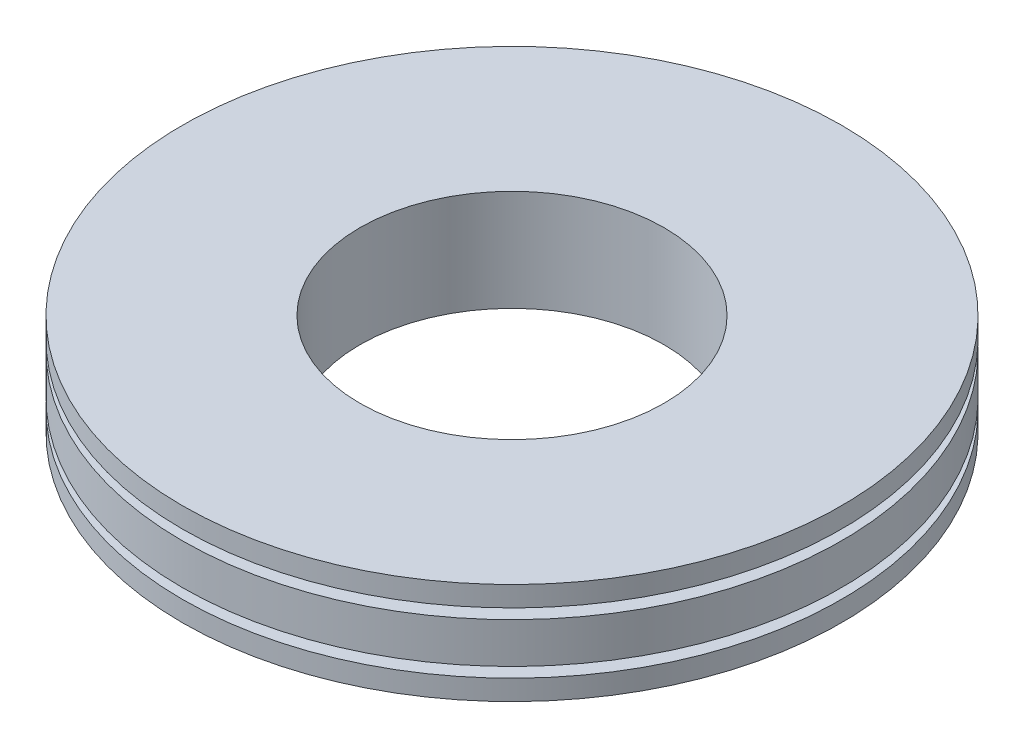
ISO-10303-21;
HEADER;
FILE_DESCRIPTION(('STEP AP214'),'2;1');
FILE_NAME('part.step','',(''),(''),'','','');
FILE_SCHEMA(('AUTOMOTIVE_DESIGN { 1 0 10303 214 1 1 1 1 }'));
ENDSEC;
DATA;
#1=APPLICATION_CONTEXT('core data for automotive mechanical design processes');
#2=APPLICATION_PROTOCOL_DEFINITION('international standard','automotive_design',2000,#1);
#3=PRODUCT_CONTEXT('',#1,'mechanical');
#4=PRODUCT('Part','Part','',(#3));
#5=PRODUCT_RELATED_PRODUCT_CATEGORY('part','',(#4));
#6=PRODUCT_DEFINITION_FORMATION('','',#4);
#7=PRODUCT_DEFINITION_CONTEXT('part definition',#1,'design');
#8=PRODUCT_DEFINITION('design','',#6,#7);
#9=PRODUCT_DEFINITION_SHAPE('','',#8);
#10=(LENGTH_UNIT() NAMED_UNIT(*) SI_UNIT(.MILLI.,.METRE.));
#11=(NAMED_UNIT(*) PLANE_ANGLE_UNIT() SI_UNIT($,.RADIAN.));
#12=(NAMED_UNIT(*) SI_UNIT($,.STERADIAN.) SOLID_ANGLE_UNIT());
#13=UNCERTAINTY_MEASURE_WITH_UNIT(LENGTH_MEASURE(1.E-05),#10,'distance_accuracy_value','');
#14=(GEOMETRIC_REPRESENTATION_CONTEXT(3) GLOBAL_UNCERTAINTY_ASSIGNED_CONTEXT((#13)) GLOBAL_UNIT_ASSIGNED_CONTEXT((#10,
#11,#12)) REPRESENTATION_CONTEXT('',''));
#15=CARTESIAN_POINT('',(0.,0.,0.));
#16=DIRECTION('',(0.,0.,1.));
#17=DIRECTION('',(1.,0.,0.));
#18=AXIS2_PLACEMENT_3D('',#15,#16,#17);
#19=CARTESIAN_POINT('',(0.,4.,0.));
#20=DIRECTION('',(0.,-1.,0.));
#21=DIRECTION('',(0.,0.,-1.));
#22=AXIS2_PLACEMENT_3D('',#19,#20,#21);
#23=CYLINDRICAL_SURFACE('',#22,13.);
#24=CARTESIAN_POINT('',(0.,4.,0.));
#25=DIRECTION('',(0.,1.,0.));
#26=DIRECTION('',(0.,0.,1.));
#27=AXIS2_PLACEMENT_3D('',#24,#25,#26);
#28=CIRCLE('',#27,13.);
#29=CARTESIAN_POINT('',(0.,4.,13.));
#30=VERTEX_POINT('',#29);
#31=EDGE_CURVE('E10',#30,#30,#28,.T.);
#32=ORIENTED_EDGE('',*,*,#31,.F.);
#33=EDGE_LOOP('',(#32));
#34=FACE_BOUND('',#33,.T.);
#35=CARTESIAN_POINT('',(0.,3.2,0.));
#36=DIRECTION('',(0.,-1.,0.));
#37=DIRECTION('',(0.,0.,-1.));
#38=AXIS2_PLACEMENT_3D('',#35,#36,#37);
#39=CIRCLE('',#38,13.);
#40=CARTESIAN_POINT('',(0.,3.2,-13.));
#41=VERTEX_POINT('',#40);
#42=EDGE_CURVE('E75',#41,#41,#39,.T.);
#43=ORIENTED_EDGE('',*,*,#42,.F.);
#44=EDGE_LOOP('',(#43));
#45=FACE_BOUND('',#44,.T.);
#46=ADVANCED_FACE('F36',(#34,#45),#23,.T.);
#47=CARTESIAN_POINT('',(0.,2.8,0.));
#48=DIRECTION('',(0.,-1.,0.));
#49=DIRECTION('',(0.,0.,-1.));
#50=AXIS2_PLACEMENT_3D('',#47,#48,#49);
#51=CIRCLE('',#50,13.);
#52=CARTESIAN_POINT('',(0.,2.8,-13.));
#53=VERTEX_POINT('',#52);
#54=EDGE_CURVE('E71',#53,#53,#51,.T.);
#55=ORIENTED_EDGE('',*,*,#54,.T.);
#56=EDGE_LOOP('',(#55));
#57=FACE_BOUND('',#56,.T.);
#58=CARTESIAN_POINT('',(0.,1.2,0.));
#59=DIRECTION('',(0.,-1.,0.));
#60=DIRECTION('',(0.,0.,-1.));
#61=AXIS2_PLACEMENT_3D('',#58,#59,#60);
#62=CIRCLE('',#61,13.);
#63=CARTESIAN_POINT('',(0.,1.2,-13.));
#64=VERTEX_POINT('',#63);
#65=EDGE_CURVE('E55',#64,#64,#62,.T.);
#66=ORIENTED_EDGE('',*,*,#65,.F.);
#67=EDGE_LOOP('',(#66));
#68=FACE_BOUND('',#67,.T.);
#69=ADVANCED_FACE('F111',(#57,#68),#23,.T.);
#70=CARTESIAN_POINT('',(0.,0.8,0.));
#71=DIRECTION('',(0.,-1.,0.));
#72=DIRECTION('',(0.,0.,-1.));
#73=AXIS2_PLACEMENT_3D('',#70,#71,#72);
#74=CIRCLE('',#73,13.);
#75=CARTESIAN_POINT('',(0.,0.8,-13.));
#76=VERTEX_POINT('',#75);
#77=EDGE_CURVE('E59',#76,#76,#74,.T.);
#78=ORIENTED_EDGE('',*,*,#77,.T.);
#79=EDGE_LOOP('',(#78));
#80=FACE_BOUND('',#79,.T.);
#81=CARTESIAN_POINT('',(0.,0.,0.));
#82=DIRECTION('',(0.,1.,0.));
#83=DIRECTION('',(0.,0.,1.));
#84=AXIS2_PLACEMENT_3D('',#81,#82,#83);
#85=CIRCLE('',#84,13.);
#86=CARTESIAN_POINT('',(0.,0.,13.));
#87=VERTEX_POINT('',#86);
#88=EDGE_CURVE('E40',#87,#87,#85,.T.);
#89=ORIENTED_EDGE('',*,*,#88,.T.);
#90=EDGE_LOOP('',(#89));
#91=FACE_BOUND('',#90,.T.);
#92=ADVANCED_FACE('F38',(#80,#91),#23,.T.);
#93=CARTESIAN_POINT('',(0.,4.,0.));
#94=DIRECTION('',(0.,1.,0.));
#95=DIRECTION('',(0.,0.,1.));
#96=AXIS2_PLACEMENT_3D('',#93,#94,#95);
#97=PLANE('',#96);
#98=CARTESIAN_POINT('',(0.,4.,0.));
#99=DIRECTION('',(0.,-1.,0.));
#100=DIRECTION('',(0.,0.,-1.));
#101=AXIS2_PLACEMENT_3D('',#98,#99,#100);
#102=CIRCLE('',#101,6.);
#103=CARTESIAN_POINT('',(0.,4.,-6.));
#104=VERTEX_POINT('',#103);
#105=EDGE_CURVE('E49',#104,#104,#102,.T.);
#106=ORIENTED_EDGE('',*,*,#105,.T.);
#107=EDGE_LOOP('',(#106));
#108=FACE_BOUND('',#107,.T.);
#109=ORIENTED_EDGE('',*,*,#31,.T.);
#110=EDGE_LOOP('',(#109));
#111=FACE_BOUND('',#110,.T.);
#112=ADVANCED_FACE('F120',(#108,#111),#97,.T.);
#113=CARTESIAN_POINT('',(0.,0.,0.));
#114=DIRECTION('',(0.,1.,0.));
#115=DIRECTION('',(0.,0.,1.));
#116=AXIS2_PLACEMENT_3D('',#113,#114,#115);
#117=PLANE('',#116);
#118=CARTESIAN_POINT('',(0.,0.,0.));
#119=DIRECTION('',(0.,-1.,0.));
#120=DIRECTION('',(0.,0.,-1.));
#121=AXIS2_PLACEMENT_3D('',#118,#119,#120);
#122=CIRCLE('',#121,6.);
#123=CARTESIAN_POINT('',(0.,0.,-6.));
#124=VERTEX_POINT('',#123);
#125=EDGE_CURVE('E51',#124,#124,#122,.T.);
#126=ORIENTED_EDGE('',*,*,#125,.F.);
#127=EDGE_LOOP('',(#126));
#128=FACE_BOUND('',#127,.T.);
#129=ORIENTED_EDGE('',*,*,#88,.F.);
#130=EDGE_LOOP('',(#129));
#131=FACE_BOUND('',#130,.T.);
#132=ADVANCED_FACE('F127',(#128,#131),#117,.F.);
#133=CARTESIAN_POINT('',(0.,4.,0.));
#134=DIRECTION('',(0.,-1.,0.));
#135=DIRECTION('',(0.,0.,-1.));
#136=AXIS2_PLACEMENT_3D('',#133,#134,#135);
#137=CYLINDRICAL_SURFACE('',#136,6.);
#138=ORIENTED_EDGE('',*,*,#105,.F.);
#139=EDGE_LOOP('',(#138));
#140=FACE_BOUND('',#139,.T.);
#141=ORIENTED_EDGE('',*,*,#125,.T.);
#142=EDGE_LOOP('',(#141));
#143=FACE_BOUND('',#142,.T.);
#144=ADVANCED_FACE('F135',(#140,#143),#137,.F.);
#145=CARTESIAN_POINT('',(0.,1.2,0.));
#146=DIRECTION('',(0.,-1.,0.));
#147=DIRECTION('',(0.,0.,-1.));
#148=AXIS2_PLACEMENT_3D('',#145,#146,#147);
#149=PLANE('',#148);
#150=CARTESIAN_POINT('',(0.,1.2,0.));
#151=DIRECTION('',(0.,-1.,0.));
#152=DIRECTION('',(0.,0.,-1.));
#153=AXIS2_PLACEMENT_3D('',#150,#151,#152);
#154=CIRCLE('',#153,12.);
#155=CARTESIAN_POINT('',(0.,1.2,-12.));
#156=VERTEX_POINT('',#155);
#157=EDGE_CURVE('E63',#156,#156,#154,.T.);
#158=ORIENTED_EDGE('',*,*,#157,.F.);
#159=EDGE_LOOP('',(#158));
#160=FACE_BOUND('',#159,.T.);
#161=ORIENTED_EDGE('',*,*,#65,.T.);
#162=EDGE_LOOP('',(#161));
#163=FACE_BOUND('',#162,.T.);
#164=ADVANCED_FACE('F140',(#160,#163),#149,.T.);
#165=CARTESIAN_POINT('',(0.,0.8,0.));
#166=DIRECTION('',(0.,-1.,0.));
#167=DIRECTION('',(0.,0.,-1.));
#168=AXIS2_PLACEMENT_3D('',#165,#166,#167);
#169=PLANE('',#168);
#170=CARTESIAN_POINT('',(0.,0.8,0.));
#171=DIRECTION('',(0.,-1.,0.));
#172=DIRECTION('',(0.,0.,-1.));
#173=AXIS2_PLACEMENT_3D('',#170,#171,#172);
#174=CIRCLE('',#173,12.);
#175=CARTESIAN_POINT('',(0.,0.8,-12.));
#176=VERTEX_POINT('',#175);
#177=EDGE_CURVE('E67',#176,#176,#174,.T.);
#178=ORIENTED_EDGE('',*,*,#177,.T.);
#179=EDGE_LOOP('',(#178));
#180=FACE_BOUND('',#179,.T.);
#181=ORIENTED_EDGE('',*,*,#77,.F.);
#182=EDGE_LOOP('',(#181));
#183=FACE_BOUND('',#182,.T.);
#184=ADVANCED_FACE('F145',(#180,#183),#169,.F.);
#185=CARTESIAN_POINT('',(0.,1.2,0.));
#186=DIRECTION('',(0.,-1.,0.));
#187=DIRECTION('',(0.,0.,-1.));
#188=AXIS2_PLACEMENT_3D('',#185,#186,#187);
#189=CYLINDRICAL_SURFACE('',#188,12.);
#190=ORIENTED_EDGE('',*,*,#157,.T.);
#191=EDGE_LOOP('',(#190));
#192=FACE_BOUND('',#191,.T.);
#193=ORIENTED_EDGE('',*,*,#177,.F.);
#194=EDGE_LOOP('',(#193));
#195=FACE_BOUND('',#194,.T.);
#196=ADVANCED_FACE('F106',(#192,#195),#189,.T.);
#197=CARTESIAN_POINT('',(0.,2.8,0.));
#198=DIRECTION('',(0.,-1.,0.));
#199=DIRECTION('',(0.,0.,-1.));
#200=AXIS2_PLACEMENT_3D('',#197,#198,#199);
#201=PLANE('',#200);
#202=ORIENTED_EDGE('',*,*,#54,.F.);
#203=EDGE_LOOP('',(#202));
#204=FACE_BOUND('',#203,.T.);
#205=CARTESIAN_POINT('',(0.,2.8,0.));
#206=DIRECTION('',(0.,-1.,0.));
#207=DIRECTION('',(0.,0.,-1.));
#208=AXIS2_PLACEMENT_3D('',#205,#206,#207);
#209=CIRCLE('',#208,12.);
#210=CARTESIAN_POINT('',(0.,2.8,-12.));
#211=VERTEX_POINT('',#210);
#212=EDGE_CURVE('E79',#211,#211,#209,.T.);
#213=ORIENTED_EDGE('',*,*,#212,.T.);
#214=EDGE_LOOP('',(#213));
#215=FACE_BOUND('',#214,.T.);
#216=ADVANCED_FACE('F91',(#204,#215),#201,.F.);
#217=CARTESIAN_POINT('',(0.,3.2,0.));
#218=DIRECTION('',(0.,-1.,0.));
#219=DIRECTION('',(0.,0.,-1.));
#220=AXIS2_PLACEMENT_3D('',#217,#218,#219);
#221=PLANE('',#220);
#222=ORIENTED_EDGE('',*,*,#42,.T.);
#223=EDGE_LOOP('',(#222));
#224=FACE_BOUND('',#223,.T.);
#225=CARTESIAN_POINT('',(0.,3.2,0.));
#226=DIRECTION('',(0.,-1.,0.));
#227=DIRECTION('',(0.,0.,-1.));
#228=AXIS2_PLACEMENT_3D('',#225,#226,#227);
#229=CIRCLE('',#228,12.);
#230=CARTESIAN_POINT('',(0.,3.2,-12.));
#231=VERTEX_POINT('',#230);
#232=EDGE_CURVE('E83',#231,#231,#229,.T.);
#233=ORIENTED_EDGE('',*,*,#232,.F.);
#234=EDGE_LOOP('',(#233));
#235=FACE_BOUND('',#234,.T.);
#236=ADVANCED_FACE('F96',(#224,#235),#221,.T.);
#237=CARTESIAN_POINT('',(0.,2.8,0.));
#238=DIRECTION('',(0.,1.,0.));
#239=DIRECTION('',(0.,0.,1.));
#240=AXIS2_PLACEMENT_3D('',#237,#238,#239);
#241=CYLINDRICAL_SURFACE('',#240,12.);
#242=ORIENTED_EDGE('',*,*,#212,.F.);
#243=EDGE_LOOP('',(#242));
#244=FACE_BOUND('',#243,.T.);
#245=ORIENTED_EDGE('',*,*,#232,.T.);
#246=EDGE_LOOP('',(#245));
#247=FACE_BOUND('',#246,.T.);
#248=ADVANCED_FACE('F93',(#244,#247),#241,.T.);
#249=CLOSED_SHELL('',(#46,#69,#92,#112,#132,#144,#164,#184,#196,#216,#236,#248));
#250=MANIFOLD_SOLID_BREP('B2',#249);
#251=ADVANCED_BREP_SHAPE_REPRESENTATION('',(#18,#250),#14);
#252=SHAPE_DEFINITION_REPRESENTATION(#9,#251);
ENDSEC;
END-ISO-10303-21;
